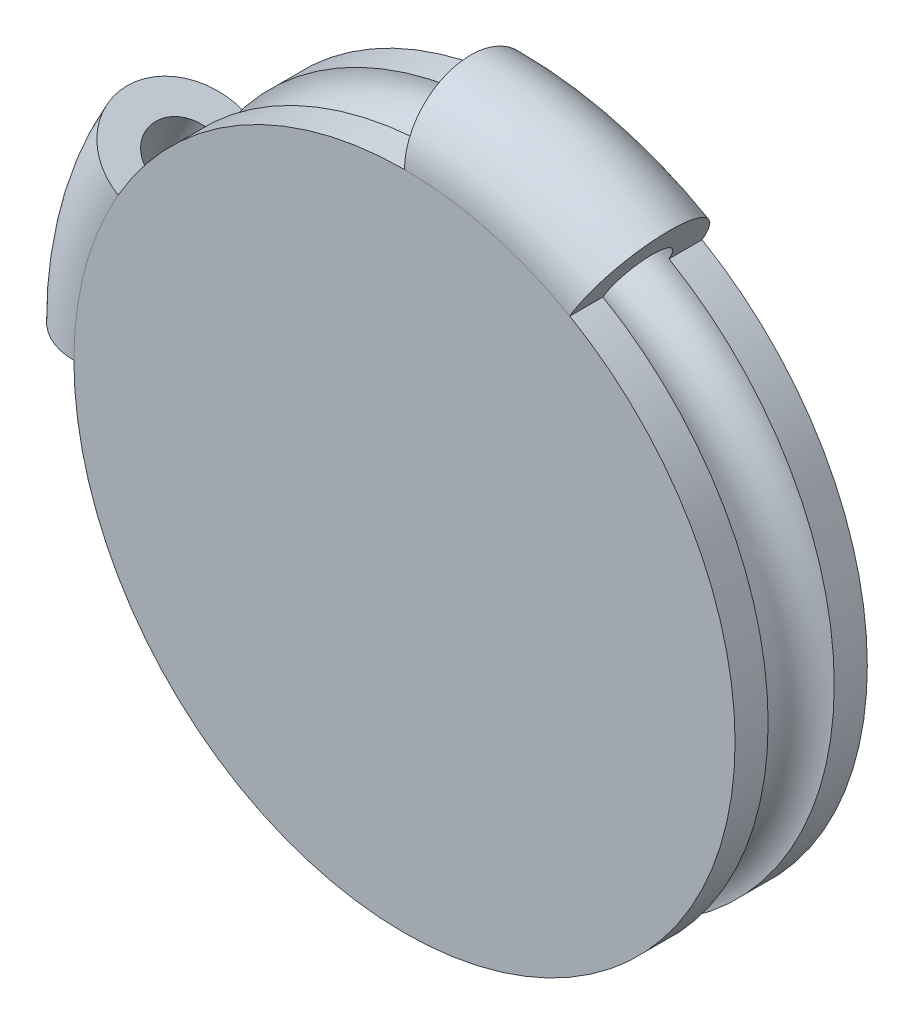
ISO-10303-21;
HEADER;
FILE_DESCRIPTION(('STEP AP214'),'2;1');
FILE_NAME('part.step','',(''),(''),'','','');
FILE_SCHEMA(('AUTOMOTIVE_DESIGN { 1 0 10303 214 1 1 1 1 }'));
ENDSEC;
DATA;
#1=APPLICATION_CONTEXT('core data for automotive mechanical design processes');
#2=APPLICATION_PROTOCOL_DEFINITION('international standard','automotive_design',2000,#1);
#3=PRODUCT_CONTEXT('',#1,'mechanical');
#4=PRODUCT('Part','Part','',(#3));
#5=PRODUCT_RELATED_PRODUCT_CATEGORY('part','',(#4));
#6=PRODUCT_DEFINITION_FORMATION('','',#4);
#7=PRODUCT_DEFINITION_CONTEXT('part definition',#1,'design');
#8=PRODUCT_DEFINITION('design','',#6,#7);
#9=PRODUCT_DEFINITION_SHAPE('','',#8);
#10=(LENGTH_UNIT() NAMED_UNIT(*) SI_UNIT(.MILLI.,.METRE.));
#11=(NAMED_UNIT(*) PLANE_ANGLE_UNIT() SI_UNIT($,.RADIAN.));
#12=(NAMED_UNIT(*) SI_UNIT($,.STERADIAN.) SOLID_ANGLE_UNIT());
#13=UNCERTAINTY_MEASURE_WITH_UNIT(LENGTH_MEASURE(1.E-05),#10,'distance_accuracy_value','');
#14=(GEOMETRIC_REPRESENTATION_CONTEXT(3) GLOBAL_UNCERTAINTY_ASSIGNED_CONTEXT((#13)) GLOBAL_UNIT_ASSIGNED_CONTEXT((#10,
#11,#12)) REPRESENTATION_CONTEXT('',''));
#15=CARTESIAN_POINT('',(0.,0.,0.));
#16=DIRECTION('',(0.,0.,1.));
#17=DIRECTION('',(1.,0.,0.));
#18=AXIS2_PLACEMENT_3D('',#15,#16,#17);
#19=CARTESIAN_POINT('',(0.,0.,0.));
#20=DIRECTION('',(0.,0.,1.));
#21=DIRECTION('',(1.,0.,0.));
#22=AXIS2_PLACEMENT_3D('',#19,#20,#21);
#23=TOROIDAL_SURFACE('',#22,10.,2.);
#24=CARTESIAN_POINT('',(-8.6602540378444,4.99999999999998,0.));
#25=DIRECTION('',(0.499999999999998,0.86602540378444,0.));
#26=DIRECTION('',(0.,0.,-1.));
#27=AXIS2_PLACEMENT_3D('',#24,#25,#26);
#28=CIRCLE('',#27,2.);
#29=CARTESIAN_POINT('',(-8.6602540378444,4.99999999999998,-2.));
#30=VERTEX_POINT('',#29);
#31=CARTESIAN_POINT('',(-8.6602540378444,4.99999999999998,2.));
#32=VERTEX_POINT('',#31);
#33=EDGE_CURVE('E313',#30,#32,#28,.T.);
#34=ORIENTED_EDGE('',*,*,#33,.F.);
#35=CARTESIAN_POINT('',(0.,0.,-2.));
#36=DIRECTION('',(0.,0.,1.));
#37=DIRECTION('',(1.,0.,0.));
#38=AXIS2_PLACEMENT_3D('',#35,#36,#37);
#39=CIRCLE('',#38,10.);
#40=CARTESIAN_POINT('',(-10.,0.,-2.));
#41=VERTEX_POINT('',#40);
#42=EDGE_CURVE('E170',#30,#41,#39,.T.);
#43=ORIENTED_EDGE('',*,*,#42,.T.);
#44=CARTESIAN_POINT('',(-10.,0.,0.));
#45=DIRECTION('',(0.,1.,0.));
#46=DIRECTION('',(0.,0.,1.));
#47=AXIS2_PLACEMENT_3D('',#44,#45,#46);
#48=CIRCLE('',#47,2.);
#49=CARTESIAN_POINT('',(-10.,0.,2.));
#50=VERTEX_POINT('',#49);
#51=EDGE_CURVE('E144',#41,#50,#48,.T.);
#52=ORIENTED_EDGE('',*,*,#51,.T.);
#53=CARTESIAN_POINT('',(0.,0.,2.));
#54=DIRECTION('',(0.,0.,1.));
#55=DIRECTION('',(1.,0.,0.));
#56=AXIS2_PLACEMENT_3D('',#53,#54,#55);
#57=CIRCLE('',#56,10.);
#58=EDGE_CURVE('E165',#32,#50,#57,.T.);
#59=ORIENTED_EDGE('',*,*,#58,.F.);
#60=EDGE_LOOP('',(#34,#43,#52,#59));
#61=FACE_BOUND('',#60,.T.);
#62=ADVANCED_FACE('F39',(#61),#23,.T.);
#63=CARTESIAN_POINT('',(0.,0.,0.));
#64=DIRECTION('',(0.,0.,-1.));
#65=DIRECTION('',(-1.,0.,0.));
#66=AXIS2_PLACEMENT_3D('',#63,#64,#65);
#67=TOROIDAL_SURFACE('',#66,10.,1.);
#68=CARTESIAN_POINT('',(5.00000000000004,8.66025403784437,0.));
#69=DIRECTION('',(0.866025403784436,-0.500000000000004,0.));
#70=DIRECTION('',(0.500000000000004,0.866025403784436,0.));
#71=AXIS2_PLACEMENT_3D('',#68,#69,#70);
#72=CIRCLE('',#71,1.);
#73=CARTESIAN_POINT('',(5.00000000000004,8.66025403784436,-1.));
#74=VERTEX_POINT('',#73);
#75=CARTESIAN_POINT('',(5.00000000000004,8.66025403784436,1.));
#76=VERTEX_POINT('',#75);
#77=EDGE_CURVE('E141',#74,#76,#72,.T.);
#78=ORIENTED_EDGE('',*,*,#77,.T.);
#79=CARTESIAN_POINT('',(0.,0.,1.));
#80=DIRECTION('',(0.,0.,-1.));
#81=DIRECTION('',(-1.,0.,0.));
#82=AXIS2_PLACEMENT_3D('',#79,#80,#81);
#83=CIRCLE('',#82,10.);
#84=CARTESIAN_POINT('',(-10.,0.,1.));
#85=VERTEX_POINT('',#84);
#86=EDGE_CURVE('E128',#85,#76,#83,.F.);
#87=ORIENTED_EDGE('',*,*,#86,.F.);
#88=CARTESIAN_POINT('',(-10.,0.,0.));
#89=DIRECTION('',(0.,1.,0.));
#90=DIRECTION('',(0.,0.,1.));
#91=AXIS2_PLACEMENT_3D('',#88,#89,#90);
#92=CIRCLE('',#91,1.);
#93=CARTESIAN_POINT('',(-10.,0.,-1.));
#94=VERTEX_POINT('',#93);
#95=EDGE_CURVE('E11',#94,#85,#92,.T.);
#96=ORIENTED_EDGE('',*,*,#95,.F.);
#97=CARTESIAN_POINT('',(0.,0.,-1.));
#98=DIRECTION('',(0.,0.,1.));
#99=DIRECTION('',(1.,0.,0.));
#100=AXIS2_PLACEMENT_3D('',#97,#98,#99);
#101=CIRCLE('',#100,10.);
#102=EDGE_CURVE('E137',#74,#94,#101,.F.);
#103=ORIENTED_EDGE('',*,*,#102,.F.);
#104=EDGE_LOOP('',(#78,#87,#96,#103));
#105=FACE_BOUND('',#104,.T.);
#106=CARTESIAN_POINT('',(-8.6602540378444,4.99999999999998,0.));
#107=DIRECTION('',(-0.499999999999998,-0.86602540378444,0.));
#108=DIRECTION('',(0.,0.,-1.));
#109=AXIS2_PLACEMENT_3D('',#106,#107,#108);
#110=CIRCLE('',#109,1.);
#111=CARTESIAN_POINT('',(-8.6602540378444,4.99999999999998,1.));
#112=VERTEX_POINT('',#111);
#113=CARTESIAN_POINT('',(-8.6602540378444,4.99999999999998,-1.));
#114=VERTEX_POINT('',#113);
#115=EDGE_CURVE('E122',#112,#114,#110,.T.);
#116=ORIENTED_EDGE('',*,*,#115,.F.);
#117=CARTESIAN_POINT('',(0.,0.,1.));
#118=DIRECTION('',(0.,0.,-1.));
#119=DIRECTION('',(-1.,0.,0.));
#120=AXIS2_PLACEMENT_3D('',#117,#118,#119);
#121=CIRCLE('',#120,10.);
#122=CARTESIAN_POINT('',(0.,10.,1.));
#123=VERTEX_POINT('',#122);
#124=EDGE_CURVE('E105',#112,#123,#121,.T.);
#125=ORIENTED_EDGE('',*,*,#124,.T.);
#126=CARTESIAN_POINT('',(0.,10.,0.));
#127=DIRECTION('',(-1.,0.,0.));
#128=DIRECTION('',(0.,0.,-1.));
#129=AXIS2_PLACEMENT_3D('',#126,#127,#128);
#130=CIRCLE('',#129,1.);
#131=CARTESIAN_POINT('',(0.,10.,-1.));
#132=VERTEX_POINT('',#131);
#133=EDGE_CURVE('E111',#123,#132,#130,.T.);
#134=ORIENTED_EDGE('',*,*,#133,.T.);
#135=CARTESIAN_POINT('',(0.,0.,-1.));
#136=DIRECTION('',(0.,0.,-1.));
#137=DIRECTION('',(-1.,0.,0.));
#138=AXIS2_PLACEMENT_3D('',#135,#136,#137);
#139=CIRCLE('',#138,10.);
#140=EDGE_CURVE('E124',#114,#132,#139,.T.);
#141=ORIENTED_EDGE('',*,*,#140,.F.);
#142=EDGE_LOOP('',(#116,#125,#134,#141));
#143=FACE_BOUND('',#142,.T.);
#144=ADVANCED_FACE('F121',(#105,#143),#67,.F.);
#145=CARTESIAN_POINT('',(0.,0.,2.));
#146=DIRECTION('',(0.,0.,-1.));
#147=DIRECTION('',(-1.,0.,0.));
#148=AXIS2_PLACEMENT_3D('',#145,#146,#147);
#149=CYLINDRICAL_SURFACE('',#148,10.);
#150=DIRECTION('',(0.,0.,-1.));
#151=VECTOR('',#150,1.);
#152=CARTESIAN_POINT('',(5.00000000000004,8.66025403784436,2.));
#153=LINE('',#152,#151);
#154=CARTESIAN_POINT('',(5.00000000000004,8.66025403784437,-2.));
#155=VERTEX_POINT('',#154);
#156=EDGE_CURVE('E158',#155,#74,#153,.F.);
#157=ORIENTED_EDGE('',*,*,#156,.T.);
#158=ORIENTED_EDGE('',*,*,#102,.T.);
#159=DIRECTION('',(0.,0.,-1.));
#160=VECTOR('',#159,1.);
#161=CARTESIAN_POINT('',(-10.,0.,2.));
#162=LINE('',#161,#160);
#163=EDGE_CURVE('E153',#41,#94,#162,.F.);
#164=ORIENTED_EDGE('',*,*,#163,.F.);
#165=EDGE_CURVE('E162',#41,#155,#39,.T.);
#166=ORIENTED_EDGE('',*,*,#165,.T.);
#167=EDGE_LOOP('',(#157,#158,#164,#166));
#168=FACE_BOUND('',#167,.T.);
#169=ADVANCED_FACE('F181',(#168),#149,.T.);
#170=EDGE_CURVE('E152',#85,#50,#162,.F.);
#171=ORIENTED_EDGE('',*,*,#170,.F.);
#172=ORIENTED_EDGE('',*,*,#86,.T.);
#173=CARTESIAN_POINT('',(5.00000000000004,8.66025403784437,2.));
#174=VERTEX_POINT('',#173);
#175=EDGE_CURVE('E157',#76,#174,#153,.F.);
#176=ORIENTED_EDGE('',*,*,#175,.T.);
#177=EDGE_CURVE('E166',#50,#174,#57,.T.);
#178=ORIENTED_EDGE('',*,*,#177,.F.);
#179=EDGE_LOOP('',(#171,#172,#176,#178));
#180=FACE_BOUND('',#179,.T.);
#181=ADVANCED_FACE('F41',(#180),#149,.T.);
#182=CARTESIAN_POINT('',(0.,0.,2.));
#183=DIRECTION('',(0.,0.,1.));
#184=DIRECTION('',(1.,0.,0.));
#185=AXIS2_PLACEMENT_3D('',#182,#183,#184);
#186=PLANE('',#185);
#187=CARTESIAN_POINT('',(0.,10.,2.));
#188=VERTEX_POINT('',#187);
#189=EDGE_CURVE('E48',#174,#188,#57,.T.);
#190=ORIENTED_EDGE('',*,*,#189,.T.);
#191=CARTESIAN_POINT('',(0.,0.,2.));
#192=DIRECTION('',(0.,0.,-1.));
#193=DIRECTION('',(-1.,0.,0.));
#194=AXIS2_PLACEMENT_3D('',#191,#192,#193);
#195=CIRCLE('',#194,10.);
#196=EDGE_CURVE('E108',#32,#188,#195,.T.);
#197=ORIENTED_EDGE('',*,*,#196,.F.);
#198=ORIENTED_EDGE('',*,*,#58,.T.);
#199=ORIENTED_EDGE('',*,*,#177,.T.);
#200=EDGE_LOOP('',(#190,#197,#198,#199));
#201=FACE_BOUND('',#200,.T.);
#202=ADVANCED_FACE('F195',(#201),#186,.T.);
#203=CARTESIAN_POINT('',(0.,0.,-2.));
#204=DIRECTION('',(0.,0.,1.));
#205=DIRECTION('',(1.,0.,0.));
#206=AXIS2_PLACEMENT_3D('',#203,#204,#205);
#207=PLANE('',#206);
#208=CARTESIAN_POINT('',(0.,10.,-2.));
#209=VERTEX_POINT('',#208);
#210=EDGE_CURVE('E167',#155,#209,#39,.T.);
#211=ORIENTED_EDGE('',*,*,#210,.F.);
#212=ORIENTED_EDGE('',*,*,#165,.F.);
#213=ORIENTED_EDGE('',*,*,#42,.F.);
#214=CARTESIAN_POINT('',(0.,0.,-2.));
#215=DIRECTION('',(0.,0.,-1.));
#216=DIRECTION('',(-1.,0.,0.));
#217=AXIS2_PLACEMENT_3D('',#214,#215,#216);
#218=CIRCLE('',#217,10.);
#219=EDGE_CURVE('E130',#30,#209,#218,.T.);
#220=ORIENTED_EDGE('',*,*,#219,.T.);
#221=EDGE_LOOP('',(#211,#212,#213,#220));
#222=FACE_BOUND('',#221,.T.);
#223=ADVANCED_FACE('F187',(#222),#207,.F.);
#224=ORIENTED_EDGE('',*,*,#210,.T.);
#225=CARTESIAN_POINT('',(0.,10.,0.));
#226=DIRECTION('',(1.,0.,0.));
#227=DIRECTION('',(0.,0.,-1.));
#228=AXIS2_PLACEMENT_3D('',#225,#226,#227);
#229=CIRCLE('',#228,2.);
#230=EDGE_CURVE('E112',#209,#188,#229,.T.);
#231=ORIENTED_EDGE('',*,*,#230,.T.);
#232=ORIENTED_EDGE('',*,*,#189,.F.);
#233=CARTESIAN_POINT('',(5.00000000000004,8.66025403784436,0.));
#234=DIRECTION('',(0.866025403784436,-0.500000000000004,0.));
#235=DIRECTION('',(0.,0.,1.));
#236=AXIS2_PLACEMENT_3D('',#233,#234,#235);
#237=CIRCLE('',#236,2.);
#238=EDGE_CURVE('E148',#155,#174,#237,.T.);
#239=ORIENTED_EDGE('',*,*,#238,.F.);
#240=EDGE_LOOP('',(#224,#231,#232,#239));
#241=FACE_BOUND('',#240,.T.);
#242=ADVANCED_FACE('F193',(#241),#23,.T.);
#243=CARTESIAN_POINT('',(5.00000000000004,8.66025403784436,0.));
#244=DIRECTION('',(0.866025403784436,-0.500000000000004,0.));
#245=DIRECTION('',(0.,0.,1.));
#246=AXIS2_PLACEMENT_3D('',#243,#244,#245);
#247=PLANE('',#246);
#248=ORIENTED_EDGE('',*,*,#77,.F.);
#249=ORIENTED_EDGE('',*,*,#156,.F.);
#250=ORIENTED_EDGE('',*,*,#238,.T.);
#251=ORIENTED_EDGE('',*,*,#175,.F.);
#252=EDGE_LOOP('',(#248,#249,#250,#251));
#253=FACE_BOUND('',#252,.T.);
#254=ADVANCED_FACE('F190',(#253),#247,.T.);
#255=CARTESIAN_POINT('',(-10.,0.,0.));
#256=DIRECTION('',(0.,1.,0.));
#257=DIRECTION('',(0.,0.,1.));
#258=AXIS2_PLACEMENT_3D('',#255,#256,#257);
#259=PLANE('',#258);
#260=ORIENTED_EDGE('',*,*,#163,.T.);
#261=ORIENTED_EDGE('',*,*,#95,.T.);
#262=ORIENTED_EDGE('',*,*,#170,.T.);
#263=ORIENTED_EDGE('',*,*,#51,.F.);
#264=EDGE_LOOP('',(#260,#261,#262,#263));
#265=FACE_BOUND('',#264,.T.);
#266=ADVANCED_FACE('F204',(#265),#259,.F.);
#267=CARTESIAN_POINT('',(0.,0.,0.));
#268=DIRECTION('',(0.,0.,-1.));
#269=DIRECTION('',(-1.,0.,0.));
#270=AXIS2_PLACEMENT_3D('',#267,#268,#269);
#271=CYLINDRICAL_SURFACE('',#270,10.);
#272=ORIENTED_EDGE('',*,*,#124,.F.);
#273=DIRECTION('',(0.,0.,-1.));
#274=VECTOR('',#273,1.);
#275=CARTESIAN_POINT('',(-8.6602540378444,4.99999999999998,2.));
#276=LINE('',#275,#274);
#277=EDGE_CURVE('E314',#32,#112,#276,.T.);
#278=ORIENTED_EDGE('',*,*,#277,.F.);
#279=ORIENTED_EDGE('',*,*,#196,.T.);
#280=DIRECTION('',(0.,0.,-1.));
#281=VECTOR('',#280,1.);
#282=CARTESIAN_POINT('',(0.,10.,2.));
#283=LINE('',#282,#281);
#284=EDGE_CURVE('E55',#188,#123,#283,.T.);
#285=ORIENTED_EDGE('',*,*,#284,.T.);
#286=EDGE_LOOP('',(#272,#278,#279,#285));
#287=FACE_BOUND('',#286,.T.);
#288=ADVANCED_FACE('F102',(#287),#271,.T.);
#289=CARTESIAN_POINT('',(0.,0.,0.));
#290=DIRECTION('',(0.,0.,-1.));
#291=DIRECTION('',(-1.,0.,0.));
#292=AXIS2_PLACEMENT_3D('',#289,#290,#291);
#293=CYLINDRICAL_SURFACE('',#292,10.);
#294=DIRECTION('',(0.,0.,-1.));
#295=VECTOR('',#294,1.);
#296=CARTESIAN_POINT('',(-8.6602540378444,4.99999999999998,-1.));
#297=LINE('',#296,#295);
#298=EDGE_CURVE('E316',#114,#30,#297,.T.);
#299=ORIENTED_EDGE('',*,*,#298,.F.);
#300=ORIENTED_EDGE('',*,*,#140,.T.);
#301=DIRECTION('',(0.,0.,-1.));
#302=VECTOR('',#301,1.);
#303=CARTESIAN_POINT('',(0.,10.,-1.));
#304=LINE('',#303,#302);
#305=EDGE_CURVE('E60',#132,#209,#304,.T.);
#306=ORIENTED_EDGE('',*,*,#305,.T.);
#307=ORIENTED_EDGE('',*,*,#219,.F.);
#308=EDGE_LOOP('',(#299,#300,#306,#307));
#309=FACE_BOUND('',#308,.T.);
#310=ADVANCED_FACE('F250',(#309),#293,.T.);
#311=CARTESIAN_POINT('',(-8.6602540378444,4.99999999999998,0.));
#312=DIRECTION('',(0.499999999999998,0.86602540378444,0.));
#313=DIRECTION('',(0.,0.,-1.));
#314=AXIS2_PLACEMENT_3D('',#311,#312,#313);
#315=PLANE('',#314);
#316=ORIENTED_EDGE('',*,*,#33,.T.);
#317=ORIENTED_EDGE('',*,*,#277,.T.);
#318=ORIENTED_EDGE('',*,*,#115,.T.);
#319=ORIENTED_EDGE('',*,*,#298,.T.);
#320=EDGE_LOOP('',(#316,#317,#318,#319));
#321=FACE_BOUND('',#320,.T.);
#322=ADVANCED_FACE('F256',(#321),#315,.T.);
#323=CARTESIAN_POINT('',(0.,10.,0.));
#324=DIRECTION('',(1.,0.,0.));
#325=DIRECTION('',(0.,0.,-1.));
#326=AXIS2_PLACEMENT_3D('',#323,#324,#325);
#327=PLANE('',#326);
#328=ORIENTED_EDGE('',*,*,#230,.F.);
#329=ORIENTED_EDGE('',*,*,#305,.F.);
#330=ORIENTED_EDGE('',*,*,#133,.F.);
#331=ORIENTED_EDGE('',*,*,#284,.F.);
#332=EDGE_LOOP('',(#328,#329,#330,#331));
#333=FACE_BOUND('',#332,.T.);
#334=ADVANCED_FACE('F115',(#333),#327,.F.);
#335=CLOSED_SHELL('',(#62,#144,#169,#181,#202,#223,#242,#254,#266,#288,#310,#322,#334));
#336=MANIFOLD_SOLID_BREP('B2',#335);
#337=ADVANCED_BREP_SHAPE_REPRESENTATION('',(#18,#336),#14);
#338=SHAPE_DEFINITION_REPRESENTATION(#9,#337);
ENDSEC;
END-ISO-10303-21;
